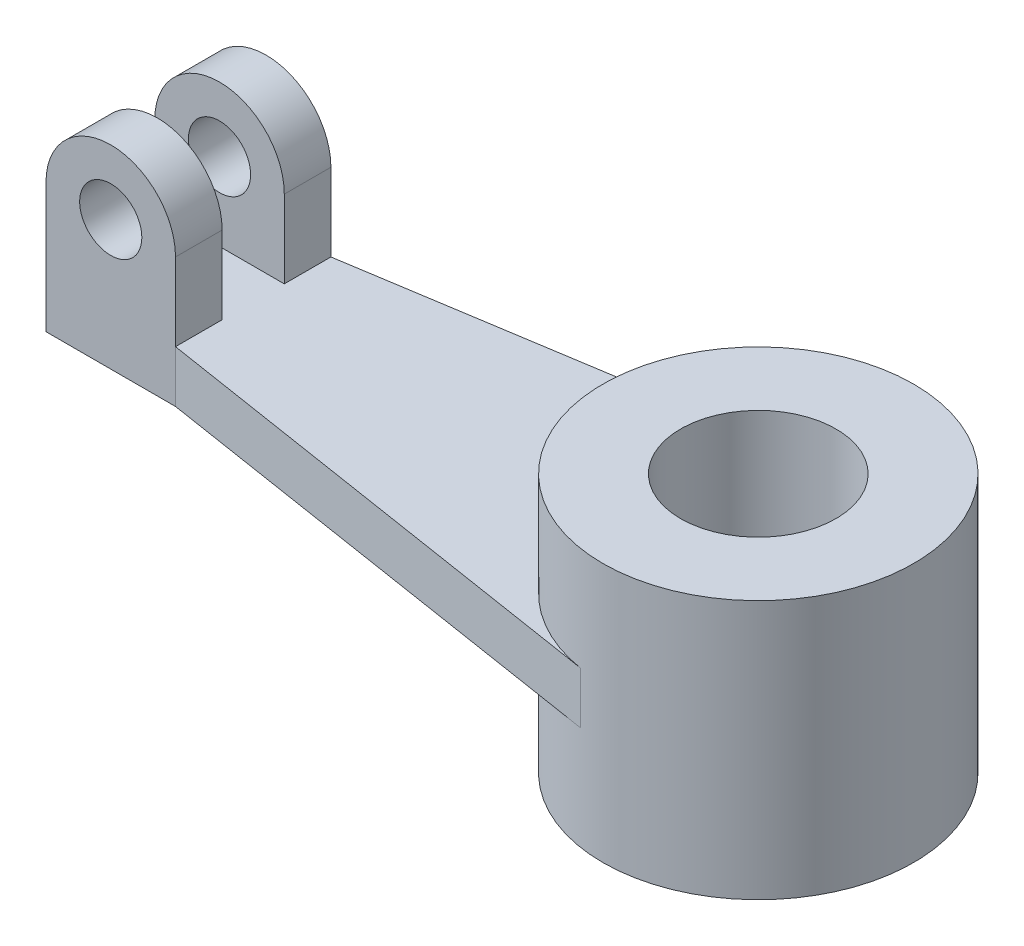
ISO-10303-21;
HEADER;
FILE_DESCRIPTION(('STEP AP214'),'2;1');
FILE_NAME('part.step','',(''),(''),'','','');
FILE_SCHEMA(('AUTOMOTIVE_DESIGN { 1 0 10303 214 1 1 1 1 }'));
ENDSEC;
DATA;
#1=APPLICATION_CONTEXT('core data for automotive mechanical design processes');
#2=APPLICATION_PROTOCOL_DEFINITION('international standard','automotive_design',2000,#1);
#3=PRODUCT_CONTEXT('',#1,'mechanical');
#4=PRODUCT('Part','Part','',(#3));
#5=PRODUCT_RELATED_PRODUCT_CATEGORY('part','',(#4));
#6=PRODUCT_DEFINITION_FORMATION('','',#4);
#7=PRODUCT_DEFINITION_CONTEXT('part definition',#1,'design');
#8=PRODUCT_DEFINITION('design','',#6,#7);
#9=PRODUCT_DEFINITION_SHAPE('','',#8);
#10=(LENGTH_UNIT() NAMED_UNIT(*) SI_UNIT(.MILLI.,.METRE.));
#11=(NAMED_UNIT(*) PLANE_ANGLE_UNIT() SI_UNIT($,.RADIAN.));
#12=(NAMED_UNIT(*) SI_UNIT($,.STERADIAN.) SOLID_ANGLE_UNIT());
#13=UNCERTAINTY_MEASURE_WITH_UNIT(LENGTH_MEASURE(1.E-05),#10,'distance_accuracy_value','');
#14=(GEOMETRIC_REPRESENTATION_CONTEXT(3) GLOBAL_UNCERTAINTY_ASSIGNED_CONTEXT((#13)) GLOBAL_UNIT_ASSIGNED_CONTEXT((#10,
#11,#12)) REPRESENTATION_CONTEXT('',''));
#15=CARTESIAN_POINT('',(0.,0.,0.));
#16=DIRECTION('',(0.,0.,1.));
#17=DIRECTION('',(1.,0.,0.));
#18=AXIS2_PLACEMENT_3D('',#15,#16,#17);
#19=CARTESIAN_POINT('',(-122.5,5.,0.));
#20=DIRECTION('',(1.,0.,0.));
#21=DIRECTION('',(0.,0.,-1.));
#22=AXIS2_PLACEMENT_3D('',#19,#20,#21);
#23=PLANE('',#22);
#24=DIRECTION('',(0.,0.,1.));
#25=VECTOR('',#24,1.);
#26=CARTESIAN_POINT('',(-122.5,-5.,0.));
#27=LINE('',#26,#25);
#28=CARTESIAN_POINT('',(-122.5,-5.,-15.));
#29=VERTEX_POINT('',#28);
#30=CARTESIAN_POINT('',(-122.5,-5.,15.));
#31=VERTEX_POINT('',#30);
#32=EDGE_CURVE('E220',#29,#31,#27,.T.);
#33=ORIENTED_EDGE('',*,*,#32,.T.);
#34=DIRECTION('',(0.,-1.,0.));
#35=VECTOR('',#34,1.);
#36=CARTESIAN_POINT('',(-122.5,5.,15.));
#37=LINE('',#36,#35);
#38=CARTESIAN_POINT('',(-122.5,20.,15.));
#39=VERTEX_POINT('',#38);
#40=EDGE_CURVE('E11',#39,#31,#37,.T.);
#41=ORIENTED_EDGE('',*,*,#40,.F.);
#42=DIRECTION('',(0.,0.,1.));
#43=VECTOR('',#42,1.);
#44=CARTESIAN_POINT('',(-122.5,20.,6.));
#45=LINE('',#44,#43);
#46=CARTESIAN_POINT('',(-122.5,20.,6.));
#47=VERTEX_POINT('',#46);
#48=EDGE_CURVE('E175',#47,#39,#45,.T.);
#49=ORIENTED_EDGE('',*,*,#48,.F.);
#50=DIRECTION('',(0.,-1.,0.));
#51=VECTOR('',#50,1.);
#52=CARTESIAN_POINT('',(-122.5,5.,6.));
#53=LINE('',#52,#51);
#54=CARTESIAN_POINT('',(-122.5,5.,6.));
#55=VERTEX_POINT('',#54);
#56=EDGE_CURVE('E160',#47,#55,#53,.T.);
#57=ORIENTED_EDGE('',*,*,#56,.T.);
#58=DIRECTION('',(0.,0.,1.));
#59=VECTOR('',#58,1.);
#60=CARTESIAN_POINT('',(-122.5,5.,0.));
#61=LINE('',#60,#59);
#62=CARTESIAN_POINT('',(-122.5,5.,-6.));
#63=VERTEX_POINT('',#62);
#64=EDGE_CURVE('E54',#63,#55,#61,.T.);
#65=ORIENTED_EDGE('',*,*,#64,.F.);
#66=DIRECTION('',(0.,1.,0.));
#67=VECTOR('',#66,1.);
#68=CARTESIAN_POINT('',(-122.5,5.,-6.));
#69=LINE('',#68,#67);
#70=CARTESIAN_POINT('',(-122.5,20.,-6.));
#71=VERTEX_POINT('',#70);
#72=EDGE_CURVE('E134',#63,#71,#69,.T.);
#73=ORIENTED_EDGE('',*,*,#72,.T.);
#74=DIRECTION('',(0.,0.,-1.));
#75=VECTOR('',#74,1.);
#76=CARTESIAN_POINT('',(-122.5,20.,-6.));
#77=LINE('',#76,#75);
#78=CARTESIAN_POINT('',(-122.5,20.,-15.));
#79=VERTEX_POINT('',#78);
#80=EDGE_CURVE('E118',#71,#79,#77,.T.);
#81=ORIENTED_EDGE('',*,*,#80,.T.);
#82=DIRECTION('',(0.,-1.,0.));
#83=VECTOR('',#82,1.);
#84=CARTESIAN_POINT('',(-122.5,5.,-15.));
#85=LINE('',#84,#83);
#86=EDGE_CURVE('E185',#79,#29,#85,.T.);
#87=ORIENTED_EDGE('',*,*,#86,.T.);
#88=EDGE_LOOP('',(#33,#41,#49,#57,#65,#73,#81,#87));
#89=FACE_BOUND('',#88,.T.);
#90=ADVANCED_FACE('F35',(#89),#23,.F.);
#91=CARTESIAN_POINT('',(0.,5.,15.));
#92=DIRECTION('',(0.,0.,-1.));
#93=DIRECTION('',(-1.,0.,0.));
#94=AXIS2_PLACEMENT_3D('',#91,#92,#93);
#95=PLANE('',#94);
#96=CARTESIAN_POINT('',(-110.,20.,15.));
#97=DIRECTION('',(0.,0.,1.));
#98=DIRECTION('',(1.,0.,0.));
#99=AXIS2_PLACEMENT_3D('',#96,#97,#98);
#100=CIRCLE('',#99,6.);
#101=CARTESIAN_POINT('',(-104.,20.,15.));
#102=VERTEX_POINT('',#101);
#103=EDGE_CURVE('E152',#102,#102,#100,.T.);
#104=ORIENTED_EDGE('',*,*,#103,.F.);
#105=EDGE_LOOP('',(#104));
#106=FACE_BOUND('',#105,.T.);
#107=DIRECTION('',(1.,0.,0.));
#108=VECTOR('',#107,1.);
#109=CARTESIAN_POINT('',(0.,-5.,15.));
#110=LINE('',#109,#108);
#111=CARTESIAN_POINT('',(-97.5,-5.,15.));
#112=VERTEX_POINT('',#111);
#113=EDGE_CURVE('E222',#31,#112,#110,.T.);
#114=ORIENTED_EDGE('',*,*,#113,.T.);
#115=DIRECTION('',(0.,-1.,0.));
#116=VECTOR('',#115,1.);
#117=CARTESIAN_POINT('',(-97.5,5.,15.));
#118=LINE('',#117,#116);
#119=CARTESIAN_POINT('',(-97.5,5.,15.));
#120=VERTEX_POINT('',#119);
#121=EDGE_CURVE('E42',#120,#112,#118,.T.);
#122=ORIENTED_EDGE('',*,*,#121,.F.);
#123=DIRECTION('',(0.,1.,0.));
#124=VECTOR('',#123,1.);
#125=CARTESIAN_POINT('',(-97.5,5.,15.));
#126=LINE('',#125,#124);
#127=CARTESIAN_POINT('',(-97.5,20.,15.));
#128=VERTEX_POINT('',#127);
#129=EDGE_CURVE('E157',#120,#128,#126,.T.);
#130=ORIENTED_EDGE('',*,*,#129,.T.);
#131=CARTESIAN_POINT('',(-110.,20.,15.));
#132=DIRECTION('',(0.,0.,1.));
#133=DIRECTION('',(1.,0.,0.));
#134=AXIS2_PLACEMENT_3D('',#131,#132,#133);
#135=CIRCLE('',#134,12.5);
#136=EDGE_CURVE('E162',#128,#39,#135,.T.);
#137=ORIENTED_EDGE('',*,*,#136,.T.);
#138=ORIENTED_EDGE('',*,*,#40,.T.);
#139=EDGE_LOOP('',(#114,#122,#130,#137,#138));
#140=FACE_BOUND('',#139,.T.);
#141=ADVANCED_FACE('F252',(#106,#140),#95,.F.);
#142=CARTESIAN_POINT('',(-4.67168875625144,5.,29.6340230843656));
#143=DIRECTION('',(0.155722958541715,0.,-0.987800769478854));
#144=DIRECTION('',(-0.987800769478854,0.,-0.155722958541715));
#145=AXIS2_PLACEMENT_3D('',#142,#143,#144);
#146=PLANE('',#145);
#147=DIRECTION('',(0.987800769478854,0.,0.155722958541715));
#148=VECTOR('',#147,1.);
#149=CARTESIAN_POINT('',(-4.67168875625144,-5.,29.6340230843656));
#150=LINE('',#149,#148);
#151=CARTESIAN_POINT('',(-4.67168875625144,-5.,29.6340230843656));
#152=VERTEX_POINT('',#151);
#153=EDGE_CURVE('E212',#112,#152,#150,.T.);
#154=ORIENTED_EDGE('',*,*,#153,.T.);
#155=DIRECTION('',(0.,-1.,0.));
#156=VECTOR('',#155,1.);
#157=CARTESIAN_POINT('',(-4.67168875625144,5.,29.6340230843656));
#158=LINE('',#157,#156);
#159=CARTESIAN_POINT('',(-4.67168875625144,5.,29.6340230843656));
#160=VERTEX_POINT('',#159);
#161=EDGE_CURVE('E217',#160,#152,#158,.T.);
#162=ORIENTED_EDGE('',*,*,#161,.F.);
#163=DIRECTION('',(0.987800769478854,0.,0.155722958541715));
#164=VECTOR('',#163,1.);
#165=CARTESIAN_POINT('',(-4.67168875625144,5.,29.6340230843656));
#166=LINE('',#165,#164);
#167=EDGE_CURVE('E214',#120,#160,#166,.T.);
#168=ORIENTED_EDGE('',*,*,#167,.F.);
#169=ORIENTED_EDGE('',*,*,#121,.T.);
#170=EDGE_LOOP('',(#154,#162,#168,#169));
#171=FACE_BOUND('',#170,.T.);
#172=ADVANCED_FACE('F230',(#171),#146,.F.);
#173=CARTESIAN_POINT('',(0.,5.,0.));
#174=DIRECTION('',(0.,1.,0.));
#175=DIRECTION('',(0.,0.,1.));
#176=AXIS2_PLACEMENT_3D('',#173,#174,#175);
#177=PLANE('',#176);
#178=DIRECTION('',(0.,0.,-1.));
#179=VECTOR('',#178,1.);
#180=CARTESIAN_POINT('',(-97.5,5.,-6.));
#181=LINE('',#180,#179);
#182=CARTESIAN_POINT('',(-97.5,5.,-6.));
#183=VERTEX_POINT('',#182);
#184=CARTESIAN_POINT('',(-97.5,5.,-15.));
#185=VERTEX_POINT('',#184);
#186=EDGE_CURVE('E149',#183,#185,#181,.T.);
#187=ORIENTED_EDGE('',*,*,#186,.F.);
#188=DIRECTION('',(-1.,0.,0.));
#189=VECTOR('',#188,1.);
#190=CARTESIAN_POINT('',(-122.5,5.,-6.));
#191=LINE('',#190,#189);
#192=EDGE_CURVE('E128',#183,#63,#191,.T.);
#193=ORIENTED_EDGE('',*,*,#192,.T.);
#194=ORIENTED_EDGE('',*,*,#64,.T.);
#195=DIRECTION('',(1.,0.,0.));
#196=VECTOR('',#195,1.);
#197=CARTESIAN_POINT('',(-122.5,5.,6.));
#198=LINE('',#197,#196);
#199=CARTESIAN_POINT('',(-97.5,5.,6.));
#200=VERTEX_POINT('',#199);
#201=EDGE_CURVE('E49',#55,#200,#198,.T.);
#202=ORIENTED_EDGE('',*,*,#201,.T.);
#203=DIRECTION('',(0.,0.,1.));
#204=VECTOR('',#203,1.);
#205=CARTESIAN_POINT('',(-97.5,5.,6.));
#206=LINE('',#205,#204);
#207=EDGE_CURVE('E170',#200,#120,#206,.T.);
#208=ORIENTED_EDGE('',*,*,#207,.T.);
#209=ORIENTED_EDGE('',*,*,#167,.T.);
#210=CARTESIAN_POINT('',(0.,5.,0.));
#211=DIRECTION('',(0.,1.,0.));
#212=DIRECTION('',(0.,0.,1.));
#213=AXIS2_PLACEMENT_3D('',#210,#211,#212);
#214=CIRCLE('',#213,30.);
#215=CARTESIAN_POINT('',(-4.67168875625144,5.,-29.6340230843656));
#216=VERTEX_POINT('',#215);
#217=EDGE_CURVE('E210',#216,#160,#214,.T.);
#218=ORIENTED_EDGE('',*,*,#217,.F.);
#219=DIRECTION('',(0.987800769478854,0.,-0.155722958541715));
#220=VECTOR('',#219,1.);
#221=CARTESIAN_POINT('',(-4.67168875625144,5.,-29.6340230843656));
#222=LINE('',#221,#220);
#223=EDGE_CURVE('E182',#185,#216,#222,.T.);
#224=ORIENTED_EDGE('',*,*,#223,.F.);
#225=EDGE_LOOP('',(#187,#193,#194,#202,#208,#209,#218,#224));
#226=FACE_BOUND('',#225,.T.);
#227=ADVANCED_FACE('F246',(#226),#177,.T.);
#228=CARTESIAN_POINT('',(0.,-5.,0.));
#229=DIRECTION('',(0.,1.,0.));
#230=DIRECTION('',(0.,0.,1.));
#231=AXIS2_PLACEMENT_3D('',#228,#229,#230);
#232=PLANE('',#231);
#233=CARTESIAN_POINT('',(0.,-5.,0.));
#234=DIRECTION('',(0.,1.,0.));
#235=DIRECTION('',(0.,0.,1.));
#236=AXIS2_PLACEMENT_3D('',#233,#234,#235);
#237=CIRCLE('',#236,30.);
#238=CARTESIAN_POINT('',(-4.67168875625144,-5.,-29.6340230843656));
#239=VERTEX_POINT('',#238);
#240=EDGE_CURVE('E207',#239,#152,#237,.T.);
#241=ORIENTED_EDGE('',*,*,#240,.T.);
#242=ORIENTED_EDGE('',*,*,#153,.F.);
#243=ORIENTED_EDGE('',*,*,#113,.F.);
#244=ORIENTED_EDGE('',*,*,#32,.F.);
#245=DIRECTION('',(1.,0.,0.));
#246=VECTOR('',#245,1.);
#247=CARTESIAN_POINT('',(0.,-5.,-15.));
#248=LINE('',#247,#246);
#249=CARTESIAN_POINT('',(-97.5,-5.,-15.));
#250=VERTEX_POINT('',#249);
#251=EDGE_CURVE('E186',#29,#250,#248,.T.);
#252=ORIENTED_EDGE('',*,*,#251,.T.);
#253=DIRECTION('',(0.987800769478854,0.,-0.155722958541715));
#254=VECTOR('',#253,1.);
#255=CARTESIAN_POINT('',(-4.67168875625144,-5.,-29.6340230843656));
#256=LINE('',#255,#254);
#257=EDGE_CURVE('E178',#250,#239,#256,.T.);
#258=ORIENTED_EDGE('',*,*,#257,.T.);
#259=EDGE_LOOP('',(#241,#242,#243,#244,#252,#258));
#260=FACE_BOUND('',#259,.T.);
#261=ADVANCED_FACE('F235',(#260),#232,.F.);
#262=CARTESIAN_POINT('',(0.,25.,0.));
#263=DIRECTION('',(0.,-1.,0.));
#264=DIRECTION('',(0.,0.,-1.));
#265=AXIS2_PLACEMENT_3D('',#262,#263,#264);
#266=CYLINDRICAL_SURFACE('',#265,30.);
#267=DIRECTION('',(0.,-1.,0.));
#268=VECTOR('',#267,1.);
#269=CARTESIAN_POINT('',(-4.67168875625144,5.,-29.6340230843656));
#270=LINE('',#269,#268);
#271=EDGE_CURVE('E194',#216,#239,#270,.T.);
#272=ORIENTED_EDGE('',*,*,#271,.F.);
#273=ORIENTED_EDGE('',*,*,#217,.T.);
#274=ORIENTED_EDGE('',*,*,#161,.T.);
#275=ORIENTED_EDGE('',*,*,#240,.F.);
#276=EDGE_LOOP('',(#272,#273,#274,#275));
#277=FACE_BOUND('',#276,.T.);
#278=CARTESIAN_POINT('',(0.,25.,0.));
#279=DIRECTION('',(0.,1.,0.));
#280=DIRECTION('',(0.,0.,1.));
#281=AXIS2_PLACEMENT_3D('',#278,#279,#280);
#282=CIRCLE('',#281,30.);
#283=CARTESIAN_POINT('',(0.,25.,30.));
#284=VERTEX_POINT('',#283);
#285=EDGE_CURVE('E204',#284,#284,#282,.T.);
#286=ORIENTED_EDGE('',*,*,#285,.F.);
#287=EDGE_LOOP('',(#286));
#288=FACE_BOUND('',#287,.T.);
#289=CARTESIAN_POINT('',(0.,-25.,0.));
#290=DIRECTION('',(0.,1.,0.));
#291=DIRECTION('',(0.,0.,1.));
#292=AXIS2_PLACEMENT_3D('',#289,#290,#291);
#293=CIRCLE('',#292,30.);
#294=CARTESIAN_POINT('',(0.,-25.,30.));
#295=VERTEX_POINT('',#294);
#296=EDGE_CURVE('E201',#295,#295,#293,.T.);
#297=ORIENTED_EDGE('',*,*,#296,.T.);
#298=EDGE_LOOP('',(#297));
#299=FACE_BOUND('',#298,.T.);
#300=ADVANCED_FACE('F239',(#277,#288,#299),#266,.T.);
#301=CARTESIAN_POINT('',(0.,25.,0.));
#302=DIRECTION('',(0.,1.,0.));
#303=DIRECTION('',(0.,0.,1.));
#304=AXIS2_PLACEMENT_3D('',#301,#302,#303);
#305=PLANE('',#304);
#306=CARTESIAN_POINT('',(0.,25.,0.));
#307=DIRECTION('',(0.,1.,0.));
#308=DIRECTION('',(0.,0.,1.));
#309=AXIS2_PLACEMENT_3D('',#306,#307,#308);
#310=CIRCLE('',#309,15.);
#311=CARTESIAN_POINT('',(0.,25.,15.));
#312=VERTEX_POINT('',#311);
#313=EDGE_CURVE('E197',#312,#312,#310,.T.);
#314=ORIENTED_EDGE('',*,*,#313,.F.);
#315=EDGE_LOOP('',(#314));
#316=FACE_BOUND('',#315,.T.);
#317=ORIENTED_EDGE('',*,*,#285,.T.);
#318=EDGE_LOOP('',(#317));
#319=FACE_BOUND('',#318,.T.);
#320=ADVANCED_FACE('F289',(#316,#319),#305,.T.);
#321=CARTESIAN_POINT('',(0.,-25.,0.));
#322=DIRECTION('',(0.,1.,0.));
#323=DIRECTION('',(0.,0.,1.));
#324=AXIS2_PLACEMENT_3D('',#321,#322,#323);
#325=PLANE('',#324);
#326=CARTESIAN_POINT('',(0.,-25.,0.));
#327=DIRECTION('',(0.,1.,0.));
#328=DIRECTION('',(0.,0.,1.));
#329=AXIS2_PLACEMENT_3D('',#326,#327,#328);
#330=CIRCLE('',#329,15.);
#331=CARTESIAN_POINT('',(0.,-25.,15.));
#332=VERTEX_POINT('',#331);
#333=EDGE_CURVE('E198',#332,#332,#330,.T.);
#334=ORIENTED_EDGE('',*,*,#333,.T.);
#335=EDGE_LOOP('',(#334));
#336=FACE_BOUND('',#335,.T.);
#337=ORIENTED_EDGE('',*,*,#296,.F.);
#338=EDGE_LOOP('',(#337));
#339=FACE_BOUND('',#338,.T.);
#340=ADVANCED_FACE('F290',(#336,#339),#325,.F.);
#341=CARTESIAN_POINT('',(0.,-25.,0.));
#342=DIRECTION('',(0.,1.,0.));
#343=DIRECTION('',(0.,0.,1.));
#344=AXIS2_PLACEMENT_3D('',#341,#342,#343);
#345=CYLINDRICAL_SURFACE('',#344,15.);
#346=ORIENTED_EDGE('',*,*,#333,.F.);
#347=EDGE_LOOP('',(#346));
#348=FACE_BOUND('',#347,.T.);
#349=ORIENTED_EDGE('',*,*,#313,.T.);
#350=EDGE_LOOP('',(#349));
#351=FACE_BOUND('',#350,.T.);
#352=ADVANCED_FACE('F293',(#348,#351),#345,.F.);
#353=CARTESIAN_POINT('',(-4.67168875625144,5.,-29.6340230843656));
#354=DIRECTION('',(-0.155722958541715,0.,-0.987800769478854));
#355=DIRECTION('',(-0.987800769478854,0.,0.155722958541715));
#356=AXIS2_PLACEMENT_3D('',#353,#354,#355);
#357=PLANE('',#356);
#358=ORIENTED_EDGE('',*,*,#257,.F.);
#359=DIRECTION('',(0.,-1.,0.));
#360=VECTOR('',#359,1.);
#361=CARTESIAN_POINT('',(-97.5,5.,-15.));
#362=LINE('',#361,#360);
#363=EDGE_CURVE('E192',#185,#250,#362,.T.);
#364=ORIENTED_EDGE('',*,*,#363,.F.);
#365=ORIENTED_EDGE('',*,*,#223,.T.);
#366=ORIENTED_EDGE('',*,*,#271,.T.);
#367=EDGE_LOOP('',(#358,#364,#365,#366));
#368=FACE_BOUND('',#367,.T.);
#369=ADVANCED_FACE('F242',(#368),#357,.T.);
#370=CARTESIAN_POINT('',(0.,5.,-15.));
#371=DIRECTION('',(0.,0.,-1.));
#372=DIRECTION('',(-1.,0.,0.));
#373=AXIS2_PLACEMENT_3D('',#370,#371,#372);
#374=PLANE('',#373);
#375=CARTESIAN_POINT('',(-110.,20.,-15.));
#376=DIRECTION('',(0.,0.,-1.));
#377=DIRECTION('',(-1.,0.,0.));
#378=AXIS2_PLACEMENT_3D('',#375,#376,#377);
#379=CIRCLE('',#378,6.);
#380=CARTESIAN_POINT('',(-116.,20.,-15.));
#381=VERTEX_POINT('',#380);
#382=EDGE_CURVE('E142',#381,#381,#379,.T.);
#383=ORIENTED_EDGE('',*,*,#382,.F.);
#384=EDGE_LOOP('',(#383));
#385=FACE_BOUND('',#384,.T.);
#386=ORIENTED_EDGE('',*,*,#251,.F.);
#387=ORIENTED_EDGE('',*,*,#86,.F.);
#388=CARTESIAN_POINT('',(-110.,20.,-15.));
#389=DIRECTION('',(0.,0.,-1.));
#390=DIRECTION('',(-1.,0.,0.));
#391=AXIS2_PLACEMENT_3D('',#388,#389,#390);
#392=CIRCLE('',#391,12.5);
#393=CARTESIAN_POINT('',(-97.5,20.,-15.));
#394=VERTEX_POINT('',#393);
#395=EDGE_CURVE('E123',#79,#394,#392,.T.);
#396=ORIENTED_EDGE('',*,*,#395,.T.);
#397=DIRECTION('',(0.,-1.,0.));
#398=VECTOR('',#397,1.);
#399=CARTESIAN_POINT('',(-97.5,5.,-15.));
#400=LINE('',#399,#398);
#401=EDGE_CURVE('E138',#394,#185,#400,.T.);
#402=ORIENTED_EDGE('',*,*,#401,.T.);
#403=ORIENTED_EDGE('',*,*,#363,.T.);
#404=EDGE_LOOP('',(#386,#387,#396,#402,#403));
#405=FACE_BOUND('',#404,.T.);
#406=ADVANCED_FACE('F303',(#385,#405),#374,.T.);
#407=CARTESIAN_POINT('',(-110.,20.,6.));
#408=DIRECTION('',(0.,0.,1.));
#409=DIRECTION('',(1.,0.,0.));
#410=AXIS2_PLACEMENT_3D('',#407,#408,#409);
#411=CYLINDRICAL_SURFACE('',#410,12.5);
#412=ORIENTED_EDGE('',*,*,#136,.F.);
#413=DIRECTION('',(0.,0.,1.));
#414=VECTOR('',#413,1.);
#415=CARTESIAN_POINT('',(-97.5,20.,6.));
#416=LINE('',#415,#414);
#417=CARTESIAN_POINT('',(-97.5,20.,6.));
#418=VERTEX_POINT('',#417);
#419=EDGE_CURVE('E179',#418,#128,#416,.T.);
#420=ORIENTED_EDGE('',*,*,#419,.F.);
#421=CARTESIAN_POINT('',(-110.,20.,6.));
#422=DIRECTION('',(0.,0.,1.));
#423=DIRECTION('',(1.,0.,0.));
#424=AXIS2_PLACEMENT_3D('',#421,#422,#423);
#425=CIRCLE('',#424,12.5);
#426=EDGE_CURVE('E167',#418,#47,#425,.T.);
#427=ORIENTED_EDGE('',*,*,#426,.T.);
#428=ORIENTED_EDGE('',*,*,#48,.T.);
#429=EDGE_LOOP('',(#412,#420,#427,#428));
#430=FACE_BOUND('',#429,.T.);
#431=ADVANCED_FACE('F254',(#430),#411,.T.);
#432=CARTESIAN_POINT('',(-97.5,5.,6.));
#433=DIRECTION('',(1.,0.,0.));
#434=DIRECTION('',(0.,0.,-1.));
#435=AXIS2_PLACEMENT_3D('',#432,#433,#434);
#436=PLANE('',#435);
#437=ORIENTED_EDGE('',*,*,#129,.F.);
#438=ORIENTED_EDGE('',*,*,#207,.F.);
#439=DIRECTION('',(0.,1.,0.));
#440=VECTOR('',#439,1.);
#441=CARTESIAN_POINT('',(-97.5,5.,6.));
#442=LINE('',#441,#440);
#443=EDGE_CURVE('E164',#200,#418,#442,.T.);
#444=ORIENTED_EDGE('',*,*,#443,.T.);
#445=ORIENTED_EDGE('',*,*,#419,.T.);
#446=EDGE_LOOP('',(#437,#438,#444,#445));
#447=FACE_BOUND('',#446,.T.);
#448=ADVANCED_FACE('F250',(#447),#436,.T.);
#449=CARTESIAN_POINT('',(-110.,20.,6.));
#450=DIRECTION('',(0.,0.,1.));
#451=DIRECTION('',(1.,0.,0.));
#452=AXIS2_PLACEMENT_3D('',#449,#450,#451);
#453=PLANE('',#452);
#454=CARTESIAN_POINT('',(-110.,20.,6.));
#455=DIRECTION('',(0.,0.,1.));
#456=DIRECTION('',(1.,0.,0.));
#457=AXIS2_PLACEMENT_3D('',#454,#455,#456);
#458=CIRCLE('',#457,6.);
#459=CARTESIAN_POINT('',(-104.,20.,6.));
#460=VERTEX_POINT('',#459);
#461=EDGE_CURVE('E154',#460,#460,#458,.T.);
#462=ORIENTED_EDGE('',*,*,#461,.T.);
#463=EDGE_LOOP('',(#462));
#464=FACE_BOUND('',#463,.T.);
#465=ORIENTED_EDGE('',*,*,#56,.F.);
#466=ORIENTED_EDGE('',*,*,#426,.F.);
#467=ORIENTED_EDGE('',*,*,#443,.F.);
#468=ORIENTED_EDGE('',*,*,#201,.F.);
#469=EDGE_LOOP('',(#465,#466,#467,#468));
#470=FACE_BOUND('',#469,.T.);
#471=ADVANCED_FACE('F258',(#464,#470),#453,.F.);
#472=CARTESIAN_POINT('',(-110.,20.,6.));
#473=DIRECTION('',(0.,0.,1.));
#474=DIRECTION('',(1.,0.,0.));
#475=AXIS2_PLACEMENT_3D('',#472,#473,#474);
#476=CYLINDRICAL_SURFACE('',#475,6.);
#477=ORIENTED_EDGE('',*,*,#461,.F.);
#478=EDGE_LOOP('',(#477));
#479=FACE_BOUND('',#478,.T.);
#480=ORIENTED_EDGE('',*,*,#103,.T.);
#481=EDGE_LOOP('',(#480));
#482=FACE_BOUND('',#481,.T.);
#483=ADVANCED_FACE('F260',(#479,#482),#476,.F.);
#484=CARTESIAN_POINT('',(-97.5,5.,-6.));
#485=DIRECTION('',(1.,0.,0.));
#486=DIRECTION('',(0.,0.,-1.));
#487=AXIS2_PLACEMENT_3D('',#484,#485,#486);
#488=PLANE('',#487);
#489=ORIENTED_EDGE('',*,*,#401,.F.);
#490=DIRECTION('',(0.,0.,-1.));
#491=VECTOR('',#490,1.);
#492=CARTESIAN_POINT('',(-97.5,20.,-6.));
#493=LINE('',#492,#491);
#494=CARTESIAN_POINT('',(-97.5,20.,-6.));
#495=VERTEX_POINT('',#494);
#496=EDGE_CURVE('E127',#495,#394,#493,.T.);
#497=ORIENTED_EDGE('',*,*,#496,.F.);
#498=DIRECTION('',(0.,-1.,0.));
#499=VECTOR('',#498,1.);
#500=CARTESIAN_POINT('',(-97.5,5.,-6.));
#501=LINE('',#500,#499);
#502=EDGE_CURVE('E135',#495,#183,#501,.T.);
#503=ORIENTED_EDGE('',*,*,#502,.T.);
#504=ORIENTED_EDGE('',*,*,#186,.T.);
#505=EDGE_LOOP('',(#489,#497,#503,#504));
#506=FACE_BOUND('',#505,.T.);
#507=ADVANCED_FACE('F267',(#506),#488,.T.);
#508=CARTESIAN_POINT('',(-110.,20.,-6.));
#509=DIRECTION('',(0.,0.,-1.));
#510=DIRECTION('',(-1.,0.,0.));
#511=AXIS2_PLACEMENT_3D('',#508,#509,#510);
#512=CYLINDRICAL_SURFACE('',#511,12.5);
#513=ORIENTED_EDGE('',*,*,#395,.F.);
#514=ORIENTED_EDGE('',*,*,#80,.F.);
#515=CARTESIAN_POINT('',(-110.,20.,-6.));
#516=DIRECTION('',(0.,0.,-1.));
#517=DIRECTION('',(-1.,0.,0.));
#518=AXIS2_PLACEMENT_3D('',#515,#516,#517);
#519=CIRCLE('',#518,12.5);
#520=EDGE_CURVE('E121',#71,#495,#519,.T.);
#521=ORIENTED_EDGE('',*,*,#520,.T.);
#522=ORIENTED_EDGE('',*,*,#496,.T.);
#523=EDGE_LOOP('',(#513,#514,#521,#522));
#524=FACE_BOUND('',#523,.T.);
#525=ADVANCED_FACE('F120',(#524),#512,.T.);
#526=CARTESIAN_POINT('',(-110.,20.,-6.));
#527=DIRECTION('',(0.,0.,-1.));
#528=DIRECTION('',(-1.,0.,0.));
#529=AXIS2_PLACEMENT_3D('',#526,#527,#528);
#530=PLANE('',#529);
#531=CARTESIAN_POINT('',(-110.,20.,-6.));
#532=DIRECTION('',(0.,0.,-1.));
#533=DIRECTION('',(-1.,0.,0.));
#534=AXIS2_PLACEMENT_3D('',#531,#532,#533);
#535=CIRCLE('',#534,6.);
#536=CARTESIAN_POINT('',(-116.,20.,-6.));
#537=VERTEX_POINT('',#536);
#538=EDGE_CURVE('E147',#537,#537,#535,.T.);
#539=ORIENTED_EDGE('',*,*,#538,.T.);
#540=EDGE_LOOP('',(#539));
#541=FACE_BOUND('',#540,.T.);
#542=ORIENTED_EDGE('',*,*,#72,.F.);
#543=ORIENTED_EDGE('',*,*,#192,.F.);
#544=ORIENTED_EDGE('',*,*,#502,.F.);
#545=ORIENTED_EDGE('',*,*,#520,.F.);
#546=EDGE_LOOP('',(#542,#543,#544,#545));
#547=FACE_BOUND('',#546,.T.);
#548=ADVANCED_FACE('F132',(#541,#547),#530,.F.);
#549=CARTESIAN_POINT('',(-110.,20.,-6.));
#550=DIRECTION('',(0.,0.,-1.));
#551=DIRECTION('',(-1.,0.,0.));
#552=AXIS2_PLACEMENT_3D('',#549,#550,#551);
#553=CYLINDRICAL_SURFACE('',#552,6.);
#554=ORIENTED_EDGE('',*,*,#538,.F.);
#555=EDGE_LOOP('',(#554));
#556=FACE_BOUND('',#555,.T.);
#557=ORIENTED_EDGE('',*,*,#382,.T.);
#558=EDGE_LOOP('',(#557));
#559=FACE_BOUND('',#558,.T.);
#560=ADVANCED_FACE('F382',(#556,#559),#553,.F.);
#561=CLOSED_SHELL('',(#90,#141,#172,#227,#261,#300,#320,#340,#352,#369,#406,#431,#448,#471,#483,
#507,#525,#548,#560));
#562=MANIFOLD_SOLID_BREP('B2',#561);
#563=ADVANCED_BREP_SHAPE_REPRESENTATION('',(#18,#562),#14);
#564=SHAPE_DEFINITION_REPRESENTATION(#9,#563);
ENDSEC;
END-ISO-10303-21;
